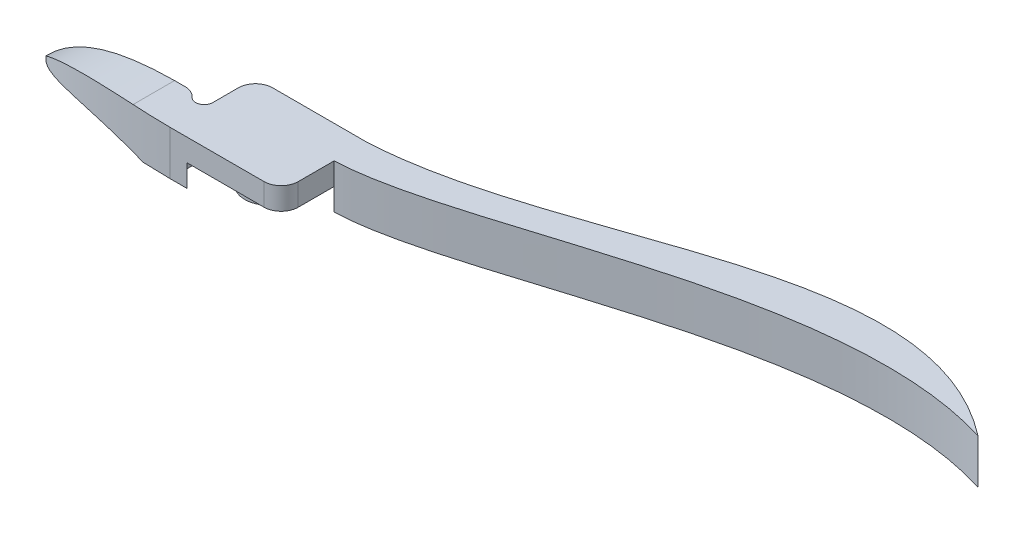
ISO-10303-21;
HEADER;
FILE_DESCRIPTION(('STEP AP214'),'2;1');
FILE_NAME('part.step','',(''),(''),'','','');
FILE_SCHEMA(('AUTOMOTIVE_DESIGN { 1 0 10303 214 1 1 1 1 }'));
ENDSEC;
DATA;
#1=APPLICATION_CONTEXT('core data for automotive mechanical design processes');
#2=APPLICATION_PROTOCOL_DEFINITION('international standard','automotive_design',2000,#1);
#3=PRODUCT_CONTEXT('',#1,'mechanical');
#4=PRODUCT('Part','Part','',(#3));
#5=PRODUCT_RELATED_PRODUCT_CATEGORY('part','',(#4));
#6=PRODUCT_DEFINITION_FORMATION('','',#4);
#7=PRODUCT_DEFINITION_CONTEXT('part definition',#1,'design');
#8=PRODUCT_DEFINITION('design','',#6,#7);
#9=PRODUCT_DEFINITION_SHAPE('','',#8);
#10=(LENGTH_UNIT() NAMED_UNIT(*) SI_UNIT(.MILLI.,.METRE.));
#11=(NAMED_UNIT(*) PLANE_ANGLE_UNIT() SI_UNIT($,.RADIAN.));
#12=(NAMED_UNIT(*) SI_UNIT($,.STERADIAN.) SOLID_ANGLE_UNIT());
#13=UNCERTAINTY_MEASURE_WITH_UNIT(LENGTH_MEASURE(1.E-05),#10,'distance_accuracy_value','');
#14=(GEOMETRIC_REPRESENTATION_CONTEXT(3) GLOBAL_UNCERTAINTY_ASSIGNED_CONTEXT((#13)) GLOBAL_UNIT_ASSIGNED_CONTEXT((#10,
#11,#12)) REPRESENTATION_CONTEXT('',''));
#15=CARTESIAN_POINT('',(0.,0.,0.));
#16=DIRECTION('',(0.,0.,1.));
#17=DIRECTION('',(1.,0.,0.));
#18=AXIS2_PLACEMENT_3D('',#15,#16,#17);
#19=CARTESIAN_POINT('',(-33.02,3.302,0.));
#20=CARTESIAN_POINT('',(-27.473096432597,3.302,6.22315986098551));
#21=CARTESIAN_POINT('',(-8.25499999999994,3.302,6.35));
#22=B_SPLINE_CURVE_WITH_KNOTS('',2,(#19,#20,#21),.UNSPECIFIED.,.F.,.F.,(3,3),(0.,1.),.UNSPECIFIED.);
#23=DIRECTION('',(0.,-1.,0.));
#24=VECTOR('',#23,1.);
#25=SURFACE_OF_LINEAR_EXTRUSION('',#22,#24);
#26=CARTESIAN_POINT('',(-33.02,-3.302,0.));
#27=CARTESIAN_POINT('',(-32.8493555262715,-3.23191102492854,0.191455572994813));
#28=CARTESIAN_POINT('',(-32.6712803221036,-3.16155099042531,0.376019685814025));
#29=CARTESIAN_POINT('',(-32.3025351047692,-3.02195048612788,0.731394631001662));
#30=CARTESIAN_POINT('',(-32.1119030977583,-2.95270736218043,0.90224378043286));
#31=CARTESIAN_POINT('',(-31.7194535669216,-2.81663188346119,1.23119449922115));
#32=CARTESIAN_POINT('',(-31.5176448250329,-2.74979770220064,1.38930584388313));
#33=CARTESIAN_POINT('',(-31.1068493182955,-2.62039434555366,1.69168586506872));
#34=CARTESIAN_POINT('',(-30.8979869134394,-2.55778164907948,1.8361053594339));
#35=CARTESIAN_POINT('',(-30.4718438568277,-2.43668640106267,2.11414393303659));
#36=CARTESIAN_POINT('',(-30.2545575546513,-2.37820669867898,2.247755570668));
#37=CARTESIAN_POINT('',(-29.8127787966357,-2.26602928752205,2.50482036263928));
#38=CARTESIAN_POINT('',(-29.5882838594076,-2.21233324993849,2.62826996570179));
#39=CARTESIAN_POINT('',(-29.0436517980687,-2.09013085422312,2.91235027700613));
#40=CARTESIAN_POINT('',(-28.7206197167618,-2.02410391595905,3.06851212350615));
#41=CARTESIAN_POINT('',(-28.0650059223243,-1.90314649690615,3.364153441573));
#42=CARTESIAN_POINT('',(-27.7324231650492,-1.84821723470581,3.50363108043291));
#43=CARTESIAN_POINT('',(-27.0596615216333,-1.74995444906151,3.76752460909254));
#44=CARTESIAN_POINT('',(-26.7194822372107,-1.70662153516172,3.89193970696487));
#45=CARTESIAN_POINT('',(-26.0307843289083,-1.63155871849199,4.12798692476388));
#46=CARTESIAN_POINT('',(-25.6822239339008,-1.59991238080401,4.23952320494405));
#47=CARTESIAN_POINT('',(-24.98053310519,-1.54876460290087,4.4501245389337));
#48=CARTESIAN_POINT('',(-24.6274031652878,-1.52926186141048,4.54919092807529));
#49=CARTESIAN_POINT('',(-23.9177111112223,-1.50240526794628,4.73606166228489));
#50=CARTESIAN_POINT('',(-23.5611487003343,-1.49505247595175,4.82386502413376));
#51=CARTESIAN_POINT('',(-22.6870108133602,-1.49188291053913,5.02593894914872));
#52=CARTESIAN_POINT('',(-22.1681212620189,-1.50262419495208,5.13469000922816));
#53=CARTESIAN_POINT('',(-21.1277968536637,-1.54914823001965,5.33374447517758));
#54=CARTESIAN_POINT('',(-20.6063611222535,-1.58494028706327,5.42404100905893));
#55=CARTESIAN_POINT('',(-19.5630919705991,-1.68143571779502,5.5885115446547));
#56=CARTESIAN_POINT('',(-19.0412584760049,-1.7421472613305,5.66268024665257));
#57=CARTESIAN_POINT('',(-18.0006763670951,-1.88827112310195,5.79667613792715));
#58=CARTESIAN_POINT('',(-17.4819232322313,-1.97361671213449,5.85654128271921));
#59=CARTESIAN_POINT('',(-16.4480455959767,-2.16921986273426,5.96387183841822));
#60=CARTESIAN_POINT('',(-15.9329198756559,-2.27946859934874,6.0113416290622));
#61=CARTESIAN_POINT('',(-14.9081383333329,-2.5252648857633,6.09536661321178));
#62=CARTESIAN_POINT('',(-14.3984793688402,-2.6607969752344,6.13192844142135));
#63=CARTESIAN_POINT('',(-13.6356505078139,-2.88471043582377,6.1798165038079));
#64=CARTESIAN_POINT('',(-13.3798295603584,-2.96342220284527,6.19470082326831));
#65=CARTESIAN_POINT('',(-12.8705555695267,-3.12759897118467,6.22214369241537));
#66=CARTESIAN_POINT('',(-12.6171001976962,-3.21305632055196,6.23470482485006));
#67=CARTESIAN_POINT('',(-12.3648063314247,-3.302,6.24619087496427));
#68=B_SPLINE_CURVE_WITH_KNOTS('',3,(#26,#27,#28,#29,#30,#31,#32,#33,#34,#35,#36,#37,#38,#39,#40,
#41,#42,#43,#44,#45,#46,#47,#48,#49,#50,#51,#52,#53,#54,#55,#56,#57,#58,#59,#60,#61,#62,#63,#64,
#65,#66,#67),.UNSPECIFIED.,.F.,.F.,(4,2,2,2,2,2,2,2,2,2,2,2,2,2,2,2,2,2,2,2,4),(0.,
0.797243659925846,1.5921762728664,2.38649290558763,3.17067983147115,3.9554021825044,
4.74039761265006,5.8340846084721,6.92789163220799,8.02175613893644,9.12329746767479,
10.2247207378736,11.3262400927683,12.9160146384745,14.5063801008409,16.0972673811179,
17.683885039876,19.2699413270169,20.8550309286911,21.6591486739592,22.4623670151177),.UNSPECIFIED.);
#69=CARTESIAN_POINT('',(-33.02,-3.302,0.));
#70=VERTEX_POINT('',#69);
#71=CARTESIAN_POINT('',(-12.3648063314247,-3.302,6.24619087474405));
#72=VERTEX_POINT('',#71);
#73=EDGE_CURVE('E361',#70,#72,#68,.T.);
#74=ORIENTED_EDGE('',*,*,#73,.T.);
#75=CARTESIAN_POINT('',(-33.02,-3.302,0.));
#76=CARTESIAN_POINT('',(-27.473096432597,-3.302,6.22315986098551));
#77=CARTESIAN_POINT('',(-8.25499999999994,-3.302,6.35));
#78=B_SPLINE_CURVE_WITH_KNOTS('',2,(#75,#76,#77),.UNSPECIFIED.,.F.,.F.,(3,3),(0.,1.),.UNSPECIFIED.);
#79=CARTESIAN_POINT('',(-8.255,-3.302,6.35));
#80=VERTEX_POINT('',#79);
#81=EDGE_CURVE('E224',#72,#80,#78,.T.);
#82=ORIENTED_EDGE('',*,*,#81,.T.);
#83=DIRECTION('',(0.,-1.,0.));
#84=VECTOR('',#83,1.);
#85=CARTESIAN_POINT('',(-8.255,3.302,6.35));
#86=LINE('',#85,#84);
#87=CARTESIAN_POINT('',(-8.255,3.302,6.35));
#88=VERTEX_POINT('',#87);
#89=EDGE_CURVE('E12',#88,#80,#86,.T.);
#90=ORIENTED_EDGE('',*,*,#89,.F.);
#91=CARTESIAN_POINT('',(-13.9218789110866,3.302,6.16184275451109));
#92=VERTEX_POINT('',#91);
#93=EDGE_CURVE('E119',#92,#88,#22,.T.);
#94=ORIENTED_EDGE('',*,*,#93,.F.);
#95=CARTESIAN_POINT('',(-13.9218789124482,3.30199999999994,6.16184275442513));
#96=CARTESIAN_POINT('',(-14.2757671587917,3.29807497459123,6.13949608522975));
#97=CARTESIAN_POINT('',(-14.6295015111341,3.29136135651999,6.11493106148992));
#98=CARTESIAN_POINT('',(-15.3366087323922,3.27172918300036,6.06100204686159));
#99=CARTESIAN_POINT('',(-15.6899813289981,3.25880749965579,6.03163564175186));
#100=CARTESIAN_POINT('',(-16.3959994084621,3.22613203775718,5.96775932544116));
#101=CARTESIAN_POINT('',(-16.7486447916846,3.20637737843231,5.93324875148313));
#102=CARTESIAN_POINT('',(-17.4580411622674,3.15900622958598,5.85814840924013));
#103=CARTESIAN_POINT('',(-17.8147761088024,3.13127821935011,5.81747658076509));
#104=CARTESIAN_POINT('',(-18.5267113011566,3.06732813468706,5.73000297352161));
#105=CARTESIAN_POINT('',(-18.8819116829497,3.03110682923011,5.6832017498687));
#106=CARTESIAN_POINT('',(-19.5903436081505,2.94936608040122,5.58298672496345));
#107=CARTESIAN_POINT('',(-19.9435748942931,2.90384545001304,5.52957207988138));
#108=CARTESIAN_POINT('',(-20.9588693978903,2.75792312557478,5.36521976693141));
#109=CARTESIAN_POINT('',(-21.6177092734333,2.64459484661716,5.24519587284131));
#110=CARTESIAN_POINT('',(-22.9212409606309,2.37628903121111,4.97615102574847));
#111=CARTESIAN_POINT('',(-23.5659305656395,2.22130504803414,4.82712558538847));
#112=CARTESIAN_POINT('',(-24.5148456016645,1.95450407200476,4.5794789719765));
#113=CARTESIAN_POINT('',(-24.827281708654,1.86016099940604,4.49318678844737));
#114=CARTESIAN_POINT('',(-25.4457787481901,1.65954853111274,4.31201146063032));
#115=CARTESIAN_POINT('',(-25.7518401045091,1.55327993120707,4.2171288896594));
#116=CARTESIAN_POINT('',(-26.3562691562426,1.3285915750584,4.01837020127277));
#117=CARTESIAN_POINT('',(-26.6546415329946,1.2101794419542,3.91449973235874));
#118=CARTESIAN_POINT('',(-27.2427587399877,0.96105209364033,3.69724172298386));
#119=CARTESIAN_POINT('',(-27.5325013541418,0.830333753500432,3.58385176602319));
#120=CARTESIAN_POINT('',(-28.218188902479,0.501000832942753,3.29886873251786));
#121=CARTESIAN_POINT('',(-28.6092813352912,0.296430002012325,3.12239130748748));
#122=CARTESIAN_POINT('',(-29.3683118481942,-0.135187222642011,2.74855160140704));
#123=CARTESIAN_POINT('',(-29.736257799875,-0.362225907233564,2.55119648228405));
#124=CARTESIAN_POINT('',(-30.209246604749,-0.677854162499141,2.27328886095922));
#125=CARTESIAN_POINT('',(-30.326002609069,-0.757819711930135,2.20259678842238));
#126=CARTESIAN_POINT('',(-30.5564976798568,-0.919752956621392,2.05868065779664));
#127=CARTESIAN_POINT('',(-30.6702372341323,-1.00172032398679,1.98545701356958));
#128=CARTESIAN_POINT('',(-31.0067870383155,-1.25039514132633,1.76188373463237));
#129=CARTESIAN_POINT('',(-31.2249605511133,-1.41989678983368,1.60761294884932));
#130=CARTESIAN_POINT('',(-31.6480344075935,-1.76467540864734,1.28806972880975));
#131=CARTESIAN_POINT('',(-31.8529425468534,-1.93994889398182,1.12280387390457));
#132=CARTESIAN_POINT('',(-32.1371239105262,-2.19432896995792,0.877014181604712));
#133=CARTESIAN_POINT('',(-32.2220217739333,-2.27186889567472,0.801317318518548));
#134=CARTESIAN_POINT('',(-32.3891206021983,-2.42748608680543,0.64758228583718));
#135=CARTESIAN_POINT('',(-32.4713221307051,-2.50556323573488,0.569544612185622));
#136=CARTESIAN_POINT('',(-32.7136458577688,-2.74013854204914,0.331907773391245));
#137=CARTESIAN_POINT('',(-32.86967332583,-2.89714783756021,0.168624454743414));
#138=CARTESIAN_POINT('',(-33.02,-3.05399492699543,0.));
#139=B_SPLINE_CURVE_WITH_KNOTS('',3,(#95,#96,#97,#98,#99,#100,#101,#102,#103,#104,#105,#106,
#107,#108,#109,#110,#111,#112,#113,#114,#115,#116,#117,#118,#119,#120,#121,#122,#123,#124,#125,
#126,#127,#128,#129,#130,#131,#132,#133,#134,#135,#136,#137,#138),.UNSPECIFIED.,.F.,.F.,(4,2,2,
2,2,2,2,2,2,2,2,2,2,2,2,2,2,2,2,2,2,4),(0.,1.06385184780087,2.12824027395346,3.19276595097234,
4.27297241019061,5.35308110686969,6.4333277607209,8.46918290407192,10.5053533024515,
11.5177893215878,12.5301578211261,13.5418946489719,14.5538890849416,15.9783987495692,
17.4024213224398,17.8769451441653,18.3513917540917,19.300156233718,20.2483580006092,
20.6612981518337,21.0741514236181,21.8989675965163),.UNSPECIFIED.);
#140=CARTESIAN_POINT('',(-33.02,-3.05399492699542,0.));
#141=VERTEX_POINT('',#140);
#142=EDGE_CURVE('E77',#92,#141,#139,.T.);
#143=ORIENTED_EDGE('',*,*,#142,.T.);
#144=DIRECTION('',(0.,-1.,0.));
#145=VECTOR('',#144,1.);
#146=CARTESIAN_POINT('',(-33.02,3.302,0.));
#147=LINE('',#146,#145);
#148=EDGE_CURVE('E180',#141,#70,#147,.T.);
#149=ORIENTED_EDGE('',*,*,#148,.T.);
#150=EDGE_LOOP('',(#74,#82,#90,#94,#143,#149));
#151=FACE_BOUND('',#150,.T.);
#152=ADVANCED_FACE('F60',(#151),#25,.F.);
#153=CARTESIAN_POINT('',(0.,3.302,0.));
#154=DIRECTION('',(0.,0.,1.));
#155=DIRECTION('',(1.,0.,0.));
#156=AXIS2_PLACEMENT_3D('',#153,#154,#155);
#157=PLANE('',#156);
#158=CARTESIAN_POINT('',(-12.3648063314247,-3.302,0.));
#159=CARTESIAN_POINT('',(-18.8048744708733,-1.03148335701843,0.));
#160=CARTESIAN_POINT('',(-26.8124714422319,-0.753963495491612,0.));
#161=CARTESIAN_POINT('',(-33.02,-3.30200000000001,0.));
#162=B_SPLINE_CURVE_WITH_KNOTS('',3,(#158,#159,#160,#161),.UNSPECIFIED.,.F.,.F.,(4,4),(0.,1.),.UNSPECIFIED.);
#163=CARTESIAN_POINT('',(-12.3648063314247,-3.302,0.));
#164=VERTEX_POINT('',#163);
#165=EDGE_CURVE('E372',#164,#70,#162,.T.);
#166=ORIENTED_EDGE('',*,*,#165,.T.);
#167=ORIENTED_EDGE('',*,*,#148,.F.);
#168=CARTESIAN_POINT('',(-33.02,-3.05399492699543,0.));
#169=CARTESIAN_POINT('',(-28.2378330119546,1.93464903660238,0.));
#170=CARTESIAN_POINT('',(-21.2907050841812,3.39591165007092,0.));
#171=CARTESIAN_POINT('',(-12.3648063314247,3.302,0.));
#172=B_SPLINE_CURVE_WITH_KNOTS('',3,(#168,#169,#170,#171),.UNSPECIFIED.,.F.,.F.,(4,4),(0.,1.),.UNSPECIFIED.);
#173=CARTESIAN_POINT('',(-13.9218789124441,3.302,0.));
#174=VERTEX_POINT('',#173);
#175=EDGE_CURVE('E203',#141,#174,#172,.T.);
#176=ORIENTED_EDGE('',*,*,#175,.T.);
#177=DIRECTION('',(-1.,0.,0.));
#178=VECTOR('',#177,1.);
#179=CARTESIAN_POINT('',(0.,3.302,0.));
#180=LINE('',#179,#178);
#181=CARTESIAN_POINT('',(-12.3648063314247,3.302,0.));
#182=VERTEX_POINT('',#181);
#183=EDGE_CURVE('E175',#182,#174,#180,.T.);
#184=ORIENTED_EDGE('',*,*,#183,.F.);
#185=DIRECTION('',(0.,-1.,0.));
#186=VECTOR('',#185,1.);
#187=CARTESIAN_POINT('',(-12.3648063314247,3.302,0.));
#188=LINE('',#187,#186);
#189=EDGE_CURVE('E86',#182,#164,#188,.T.);
#190=ORIENTED_EDGE('',*,*,#189,.T.);
#191=EDGE_LOOP('',(#166,#167,#176,#184,#190));
#192=FACE_BOUND('',#191,.T.);
#193=ADVANCED_FACE('F351',(#192),#157,.F.);
#194=CARTESIAN_POINT('',(0.,-3.302,0.));
#195=DIRECTION('',(0.,1.,0.));
#196=DIRECTION('',(0.,0.,1.));
#197=AXIS2_PLACEMENT_3D('',#194,#195,#196);
#198=PLANE('',#197);
#199=DIRECTION('',(0.,0.,-1.));
#200=VECTOR('',#199,1.);
#201=CARTESIAN_POINT('',(-12.3648063314247,-3.302,6.351));
#202=LINE('',#201,#200);
#203=EDGE_CURVE('E212',#72,#164,#202,.T.);
#204=ORIENTED_EDGE('',*,*,#203,.T.);
#205=CARTESIAN_POINT('',(-12.3648063314247,-3.302,2.54));
#206=DIRECTION('',(0.,1.,0.));
#207=DIRECTION('',(0.,0.,1.));
#208=AXIS2_PLACEMENT_3D('',#205,#206,#207);
#209=CIRCLE('',#208,2.54);
#210=CARTESIAN_POINT('',(-10.4716021104749,-3.302,0.846666666666668));
#211=VERTEX_POINT('',#210);
#212=EDGE_CURVE('E247',#164,#211,#209,.F.);
#213=ORIENTED_EDGE('',*,*,#212,.T.);
#214=CARTESIAN_POINT('',(-9.525,-3.302,0.));
#215=DIRECTION('',(0.,1.,0.));
#216=DIRECTION('',(0.,0.,1.));
#217=AXIS2_PLACEMENT_3D('',#214,#215,#216);
#218=CIRCLE('',#217,1.27);
#219=CARTESIAN_POINT('',(-8.255,-3.302,0.));
#220=VERTEX_POINT('',#219);
#221=EDGE_CURVE('E244',#211,#220,#218,.T.);
#222=ORIENTED_EDGE('',*,*,#221,.T.);
#223=DIRECTION('',(0.,0.,1.));
#224=VECTOR('',#223,1.);
#225=CARTESIAN_POINT('',(-8.255,-3.302,0.));
#226=LINE('',#225,#224);
#227=CARTESIAN_POINT('',(-8.255,-3.302,3.80999999999998));
#228=VERTEX_POINT('',#227);
#229=EDGE_CURVE('E241',#220,#228,#226,.T.);
#230=ORIENTED_EDGE('',*,*,#229,.T.);
#231=CARTESIAN_POINT('',(-5.715,-3.302,3.81));
#232=DIRECTION('',(0.,1.,0.));
#233=DIRECTION('',(0.,0.,1.));
#234=AXIS2_PLACEMENT_3D('',#231,#232,#233);
#235=CIRCLE('',#234,2.54);
#236=CARTESIAN_POINT('',(-5.71499999999998,-3.302,6.35));
#237=VERTEX_POINT('',#236);
#238=EDGE_CURVE('E238',#228,#237,#235,.T.);
#239=ORIENTED_EDGE('',*,*,#238,.T.);
#240=DIRECTION('',(-1.,0.,0.));
#241=VECTOR('',#240,1.);
#242=CARTESIAN_POINT('',(0.,-3.302,6.35));
#243=LINE('',#242,#241);
#244=EDGE_CURVE('E232',#237,#80,#243,.T.);
#245=ORIENTED_EDGE('',*,*,#244,.T.);
#246=ORIENTED_EDGE('',*,*,#81,.F.);
#247=EDGE_LOOP('',(#204,#213,#222,#230,#239,#245,#246));
#248=FACE_BOUND('',#247,.T.);
#249=ADVANCED_FACE('F356',(#248),#198,.F.);
#250=CARTESIAN_POINT('',(0.,3.302,0.));
#251=DIRECTION('',(0.,1.,0.));
#252=DIRECTION('',(0.,0.,1.));
#253=AXIS2_PLACEMENT_3D('',#250,#251,#252);
#254=PLANE('',#253);
#255=ORIENTED_EDGE('',*,*,#183,.T.);
#256=DIRECTION('',(0.,0.,-1.));
#257=VECTOR('',#256,1.);
#258=CARTESIAN_POINT('',(-13.9218789124441,3.302,6.351));
#259=LINE('',#258,#257);
#260=EDGE_CURVE('E201',#92,#174,#259,.T.);
#261=ORIENTED_EDGE('',*,*,#260,.F.);
#262=ORIENTED_EDGE('',*,*,#93,.T.);
#263=DIRECTION('',(1.,0.,0.));
#264=VECTOR('',#263,1.);
#265=CARTESIAN_POINT('',(0.,3.302,6.35));
#266=LINE('',#265,#264);
#267=CARTESIAN_POINT('',(5.71499999999998,3.302,6.35));
#268=VERTEX_POINT('',#267);
#269=EDGE_CURVE('E302',#88,#268,#266,.T.);
#270=ORIENTED_EDGE('',*,*,#269,.T.);
#271=CARTESIAN_POINT('',(5.715,3.302,3.81));
#272=DIRECTION('',(0.,1.,0.));
#273=DIRECTION('',(0.,0.,1.));
#274=AXIS2_PLACEMENT_3D('',#271,#272,#273);
#275=CIRCLE('',#274,2.54);
#276=CARTESIAN_POINT('',(8.255,3.302,3.80999999999998));
#277=VERTEX_POINT('',#276);
#278=EDGE_CURVE('E308',#268,#277,#275,.T.);
#279=ORIENTED_EDGE('',*,*,#278,.T.);
#280=DIRECTION('',(0.,0.,1.));
#281=VECTOR('',#280,1.);
#282=CARTESIAN_POINT('',(8.255,3.302,0.));
#283=LINE('',#282,#281);
#284=CARTESIAN_POINT('',(8.255,3.302,-1.524));
#285=VERTEX_POINT('',#284);
#286=EDGE_CURVE('E310',#285,#277,#283,.T.);
#287=ORIENTED_EDGE('',*,*,#286,.F.);
#288=CARTESIAN_POINT('',(8.255,3.302,-1.524));
#289=CARTESIAN_POINT('',(26.9221441817597,3.302,-2.15084961746132));
#290=CARTESIAN_POINT('',(62.6462462616133,3.302,-22.822886737911));
#291=CARTESIAN_POINT('',(91.4400000000001,3.302,-13.97));
#292=B_SPLINE_CURVE_WITH_KNOTS('',3,(#288,#289,#290,#291),.UNSPECIFIED.,.F.,.F.,(4,4),(0.,1.),.UNSPECIFIED.);
#293=CARTESIAN_POINT('',(91.4400000000001,3.302,-13.97));
#294=VERTEX_POINT('',#293);
#295=EDGE_CURVE('E313',#285,#294,#292,.T.);
#296=ORIENTED_EDGE('',*,*,#295,.T.);
#297=CARTESIAN_POINT('',(91.44,3.302,-13.97));
#298=CARTESIAN_POINT('',(66.350363847713,3.302,-33.3520512179018));
#299=CARTESIAN_POINT('',(36.8413371265353,3.302,-7.76465399928655));
#300=CARTESIAN_POINT('',(8.25499999999984,3.302,-6.35));
#301=B_SPLINE_CURVE_WITH_KNOTS('',3,(#297,#298,#299,#300),.UNSPECIFIED.,.F.,.F.,(4,4),(0.,1.),.UNSPECIFIED.);
#302=CARTESIAN_POINT('',(8.255,3.302,-6.35));
#303=VERTEX_POINT('',#302);
#304=EDGE_CURVE('E318',#294,#303,#301,.T.);
#305=ORIENTED_EDGE('',*,*,#304,.T.);
#306=DIRECTION('',(1.,0.,0.));
#307=VECTOR('',#306,1.);
#308=CARTESIAN_POINT('',(0.,3.302,-6.35));
#309=LINE('',#308,#307);
#310=CARTESIAN_POINT('',(-5.71499999999998,3.302,-6.35));
#311=VERTEX_POINT('',#310);
#312=EDGE_CURVE('E430',#311,#303,#309,.T.);
#313=ORIENTED_EDGE('',*,*,#312,.F.);
#314=CARTESIAN_POINT('',(-5.715,3.302,-3.81));
#315=DIRECTION('',(0.,1.,0.));
#316=DIRECTION('',(0.,0.,1.));
#317=AXIS2_PLACEMENT_3D('',#314,#315,#316);
#318=CIRCLE('',#317,2.54);
#319=CARTESIAN_POINT('',(-8.255,3.302,-3.80999999999998));
#320=VERTEX_POINT('',#319);
#321=EDGE_CURVE('E155',#311,#320,#318,.T.);
#322=ORIENTED_EDGE('',*,*,#321,.T.);
#323=DIRECTION('',(0.,0.,1.));
#324=VECTOR('',#323,1.);
#325=CARTESIAN_POINT('',(-8.255,3.302,0.));
#326=LINE('',#325,#324);
#327=CARTESIAN_POINT('',(-8.255,3.302,0.));
#328=VERTEX_POINT('',#327);
#329=EDGE_CURVE('E146',#320,#328,#326,.T.);
#330=ORIENTED_EDGE('',*,*,#329,.T.);
#331=CARTESIAN_POINT('',(-9.525,3.302,0.));
#332=DIRECTION('',(0.,1.,0.));
#333=DIRECTION('',(0.,0.,1.));
#334=AXIS2_PLACEMENT_3D('',#331,#332,#333);
#335=CIRCLE('',#334,1.27);
#336=CARTESIAN_POINT('',(-10.4716021104749,3.302,0.846666666666668));
#337=VERTEX_POINT('',#336);
#338=EDGE_CURVE('E152',#337,#328,#335,.T.);
#339=ORIENTED_EDGE('',*,*,#338,.F.);
#340=CARTESIAN_POINT('',(-12.3648063314247,3.302,2.54));
#341=DIRECTION('',(0.,1.,0.));
#342=DIRECTION('',(0.,0.,1.));
#343=AXIS2_PLACEMENT_3D('',#340,#341,#342);
#344=CIRCLE('',#343,2.54);
#345=EDGE_CURVE('E173',#182,#337,#344,.F.);
#346=ORIENTED_EDGE('',*,*,#345,.F.);
#347=EDGE_LOOP('',(#255,#261,#262,#270,#279,#287,#296,#305,#313,#322,#330,#339,#346));
#348=FACE_BOUND('',#347,.T.);
#349=ADVANCED_FACE('F149',(#348),#254,.T.);
#350=CARTESIAN_POINT('',(0.,0.,0.));
#351=DIRECTION('',(0.,1.,0.));
#352=DIRECTION('',(0.,0.,1.));
#353=AXIS2_PLACEMENT_3D('',#350,#351,#352);
#354=PLANE('',#353);
#355=CARTESIAN_POINT('',(0.,0.,0.));
#356=DIRECTION('',(0.,1.,0.));
#357=DIRECTION('',(0.,0.,1.));
#358=AXIS2_PLACEMENT_3D('',#355,#356,#357);
#359=CIRCLE('',#358,3.4925);
#360=CARTESIAN_POINT('',(0.,0.,3.4925));
#361=VERTEX_POINT('',#360);
#362=EDGE_CURVE('E373',#361,#361,#359,.T.);
#363=ORIENTED_EDGE('',*,*,#362,.T.);
#364=EDGE_LOOP('',(#363));
#365=FACE_BOUND('',#364,.T.);
#366=DIRECTION('',(0.,0.,1.));
#367=VECTOR('',#366,1.);
#368=CARTESIAN_POINT('',(-8.255,0.,0.));
#369=LINE('',#368,#367);
#370=CARTESIAN_POINT('',(-8.255,0.,0.));
#371=VERTEX_POINT('',#370);
#372=CARTESIAN_POINT('',(-8.255,0.,3.80999999999998));
#373=VERTEX_POINT('',#372);
#374=EDGE_CURVE('E207',#371,#373,#369,.T.);
#375=ORIENTED_EDGE('',*,*,#374,.F.);
#376=DIRECTION('',(0.,0.,1.));
#377=VECTOR('',#376,1.);
#378=CARTESIAN_POINT('',(-8.255,0.,0.));
#379=LINE('',#378,#377);
#380=CARTESIAN_POINT('',(-8.255,0.,-3.80999999999998));
#381=VERTEX_POINT('',#380);
#382=EDGE_CURVE('E164',#381,#371,#379,.T.);
#383=ORIENTED_EDGE('',*,*,#382,.F.);
#384=CARTESIAN_POINT('',(-5.715,0.,-3.81));
#385=DIRECTION('',(0.,1.,0.));
#386=DIRECTION('',(0.,0.,1.));
#387=AXIS2_PLACEMENT_3D('',#384,#385,#386);
#388=CIRCLE('',#387,2.54);
#389=CARTESIAN_POINT('',(-5.71499999999998,0.,-6.35));
#390=VERTEX_POINT('',#389);
#391=EDGE_CURVE('E111',#390,#381,#388,.T.);
#392=ORIENTED_EDGE('',*,*,#391,.F.);
#393=DIRECTION('',(1.,0.,0.));
#394=VECTOR('',#393,1.);
#395=CARTESIAN_POINT('',(0.,0.,-6.35));
#396=LINE('',#395,#394);
#397=CARTESIAN_POINT('',(5.71499999999998,0.,-6.35));
#398=VERTEX_POINT('',#397);
#399=EDGE_CURVE('E190',#390,#398,#396,.T.);
#400=ORIENTED_EDGE('',*,*,#399,.T.);
#401=CARTESIAN_POINT('',(5.715,0.,-3.81));
#402=DIRECTION('',(0.,1.,0.));
#403=DIRECTION('',(0.,0.,1.));
#404=AXIS2_PLACEMENT_3D('',#401,#402,#403);
#405=CIRCLE('',#404,2.54);
#406=CARTESIAN_POINT('',(8.255,0.,-3.80999999999998));
#407=VERTEX_POINT('',#406);
#408=EDGE_CURVE('E256',#398,#407,#405,.F.);
#409=ORIENTED_EDGE('',*,*,#408,.T.);
#410=DIRECTION('',(0.,0.,1.));
#411=VECTOR('',#410,1.);
#412=CARTESIAN_POINT('',(8.255,0.,0.));
#413=LINE('',#412,#411);
#414=CARTESIAN_POINT('',(8.255,0.,-1.524));
#415=VERTEX_POINT('',#414);
#416=EDGE_CURVE('E268',#407,#415,#413,.T.);
#417=ORIENTED_EDGE('',*,*,#416,.T.);
#418=DIRECTION('',(0.,0.,1.));
#419=VECTOR('',#418,1.);
#420=CARTESIAN_POINT('',(8.255,0.,0.));
#421=LINE('',#420,#419);
#422=CARTESIAN_POINT('',(8.255,0.,3.80999999999998));
#423=VERTEX_POINT('',#422);
#424=EDGE_CURVE('E187',#415,#423,#421,.T.);
#425=ORIENTED_EDGE('',*,*,#424,.T.);
#426=CARTESIAN_POINT('',(5.715,0.,3.81));
#427=DIRECTION('',(0.,1.,0.));
#428=DIRECTION('',(0.,0.,1.));
#429=AXIS2_PLACEMENT_3D('',#426,#427,#428);
#430=CIRCLE('',#429,2.54);
#431=CARTESIAN_POINT('',(5.71499999999998,0.,6.35));
#432=VERTEX_POINT('',#431);
#433=EDGE_CURVE('E183',#432,#423,#430,.T.);
#434=ORIENTED_EDGE('',*,*,#433,.F.);
#435=DIRECTION('',(1.,0.,0.));
#436=VECTOR('',#435,1.);
#437=CARTESIAN_POINT('',(0.,0.,6.35));
#438=LINE('',#437,#436);
#439=CARTESIAN_POINT('',(-5.71499999999998,0.,6.35));
#440=VERTEX_POINT('',#439);
#441=EDGE_CURVE('E181',#440,#432,#438,.T.);
#442=ORIENTED_EDGE('',*,*,#441,.F.);
#443=CARTESIAN_POINT('',(-5.715,0.,3.81));
#444=DIRECTION('',(0.,1.,0.));
#445=DIRECTION('',(0.,0.,1.));
#446=AXIS2_PLACEMENT_3D('',#443,#444,#445);
#447=CIRCLE('',#446,2.54);
#448=EDGE_CURVE('E202',#373,#440,#447,.T.);
#449=ORIENTED_EDGE('',*,*,#448,.F.);
#450=EDGE_LOOP('',(#375,#383,#392,#400,#409,#417,#425,#434,#442,#449));
#451=FACE_BOUND('',#450,.T.);
#452=ADVANCED_FACE('F343',(#365,#451),#354,.F.);
#453=CARTESIAN_POINT('',(0.,3.302,6.35));
#454=DIRECTION('',(0.,0.,-1.));
#455=DIRECTION('',(-1.,0.,0.));
#456=AXIS2_PLACEMENT_3D('',#453,#454,#455);
#457=PLANE('',#456);
#458=ORIENTED_EDGE('',*,*,#89,.T.);
#459=ORIENTED_EDGE('',*,*,#244,.F.);
#460=DIRECTION('',(0.,1.,0.));
#461=VECTOR('',#460,1.);
#462=CARTESIAN_POINT('',(-5.71499999999998,-3.302,6.35));
#463=LINE('',#462,#461);
#464=EDGE_CURVE('E249',#237,#440,#463,.T.);
#465=ORIENTED_EDGE('',*,*,#464,.T.);
#466=ORIENTED_EDGE('',*,*,#441,.T.);
#467=DIRECTION('',(0.,-1.,0.));
#468=VECTOR('',#467,1.);
#469=CARTESIAN_POINT('',(5.71499999999998,3.302,6.35));
#470=LINE('',#469,#468);
#471=EDGE_CURVE('E69',#268,#432,#470,.T.);
#472=ORIENTED_EDGE('',*,*,#471,.F.);
#473=ORIENTED_EDGE('',*,*,#269,.F.);
#474=EDGE_LOOP('',(#458,#459,#465,#466,#472,#473));
#475=FACE_BOUND('',#474,.T.);
#476=ADVANCED_FACE('F340',(#475),#457,.F.);
#477=CARTESIAN_POINT('',(5.715,3.302,3.81));
#478=DIRECTION('',(0.,-1.,0.));
#479=DIRECTION('',(0.,0.,-1.));
#480=AXIS2_PLACEMENT_3D('',#477,#478,#479);
#481=CYLINDRICAL_SURFACE('',#480,2.54);
#482=ORIENTED_EDGE('',*,*,#433,.T.);
#483=DIRECTION('',(0.,-1.,0.));
#484=VECTOR('',#483,1.);
#485=CARTESIAN_POINT('',(8.255,3.302,3.80999999999998));
#486=LINE('',#485,#484);
#487=EDGE_CURVE('E448',#277,#423,#486,.T.);
#488=ORIENTED_EDGE('',*,*,#487,.F.);
#489=ORIENTED_EDGE('',*,*,#278,.F.);
#490=ORIENTED_EDGE('',*,*,#471,.T.);
#491=EDGE_LOOP('',(#482,#488,#489,#490));
#492=FACE_BOUND('',#491,.T.);
#493=ADVANCED_FACE('F337',(#492),#481,.T.);
#494=CARTESIAN_POINT('',(8.255,3.302,0.));
#495=DIRECTION('',(1.,0.,0.));
#496=DIRECTION('',(0.,0.,-1.));
#497=AXIS2_PLACEMENT_3D('',#494,#495,#496);
#498=PLANE('',#497);
#499=ORIENTED_EDGE('',*,*,#424,.F.);
#500=DIRECTION('',(0.,-1.,0.));
#501=VECTOR('',#500,1.);
#502=CARTESIAN_POINT('',(8.255,3.302,-1.524));
#503=LINE('',#502,#501);
#504=EDGE_CURVE('E443',#285,#415,#503,.T.);
#505=ORIENTED_EDGE('',*,*,#504,.F.);
#506=ORIENTED_EDGE('',*,*,#286,.T.);
#507=ORIENTED_EDGE('',*,*,#487,.T.);
#508=EDGE_LOOP('',(#499,#505,#506,#507));
#509=FACE_BOUND('',#508,.T.);
#510=ADVANCED_FACE('F332',(#509),#498,.T.);
#511=DIRECTION('',(0.,-1.,0.));
#512=VECTOR('',#511,1.);
#513=SURFACE_OF_LINEAR_EXTRUSION('',#292,#512);
#514=ORIENTED_EDGE('',*,*,#504,.T.);
#515=DIRECTION('',(0.,1.,0.));
#516=VECTOR('',#515,1.);
#517=CARTESIAN_POINT('',(8.255,-3.302,-1.524));
#518=LINE('',#517,#516);
#519=CARTESIAN_POINT('',(8.255,-3.302,-1.524));
#520=VERTEX_POINT('',#519);
#521=EDGE_CURVE('E184',#520,#415,#518,.T.);
#522=ORIENTED_EDGE('',*,*,#521,.F.);
#523=CARTESIAN_POINT('',(8.255,-3.302,-1.524));
#524=CARTESIAN_POINT('',(26.9221441817597,-3.302,-2.15084961746132));
#525=CARTESIAN_POINT('',(62.6462462616133,-3.302,-22.822886737911));
#526=CARTESIAN_POINT('',(91.4400000000001,-3.302,-13.97));
#527=B_SPLINE_CURVE_WITH_KNOTS('',3,(#523,#524,#525,#526),.UNSPECIFIED.,.F.,.F.,(4,4),(0.,1.),.UNSPECIFIED.);
#528=CARTESIAN_POINT('',(91.4400000000001,-3.302,-13.97));
#529=VERTEX_POINT('',#528);
#530=EDGE_CURVE('E262',#520,#529,#527,.T.);
#531=ORIENTED_EDGE('',*,*,#530,.T.);
#532=DIRECTION('',(0.,-1.,0.));
#533=VECTOR('',#532,1.);
#534=CARTESIAN_POINT('',(91.4400000000001,3.302,-13.97));
#535=LINE('',#534,#533);
#536=EDGE_CURVE('E441',#294,#529,#535,.T.);
#537=ORIENTED_EDGE('',*,*,#536,.F.);
#538=ORIENTED_EDGE('',*,*,#295,.F.);
#539=EDGE_LOOP('',(#514,#522,#531,#537,#538));
#540=FACE_BOUND('',#539,.T.);
#541=ADVANCED_FACE('F327',(#540),#513,.F.);
#542=DIRECTION('',(0.,-1.,0.));
#543=VECTOR('',#542,1.);
#544=SURFACE_OF_LINEAR_EXTRUSION('',#301,#543);
#545=ORIENTED_EDGE('',*,*,#536,.T.);
#546=CARTESIAN_POINT('',(91.44,-3.302,-13.97));
#547=CARTESIAN_POINT('',(66.350363847713,-3.302,-33.3520512179018));
#548=CARTESIAN_POINT('',(36.8413371265353,-3.302,-7.76465399928655));
#549=CARTESIAN_POINT('',(8.25499999999984,-3.302,-6.35));
#550=B_SPLINE_CURVE_WITH_KNOTS('',3,(#546,#547,#548,#549),.UNSPECIFIED.,.F.,.F.,(4,4),(0.,1.),.UNSPECIFIED.);
#551=CARTESIAN_POINT('',(8.255,-3.302,-6.35));
#552=VERTEX_POINT('',#551);
#553=EDGE_CURVE('E267',#529,#552,#550,.T.);
#554=ORIENTED_EDGE('',*,*,#553,.T.);
#555=DIRECTION('',(0.,-1.,0.));
#556=VECTOR('',#555,1.);
#557=CARTESIAN_POINT('',(8.255,3.302,-6.35));
#558=LINE('',#557,#556);
#559=EDGE_CURVE('E431',#303,#552,#558,.T.);
#560=ORIENTED_EDGE('',*,*,#559,.F.);
#561=ORIENTED_EDGE('',*,*,#304,.F.);
#562=EDGE_LOOP('',(#545,#554,#560,#561));
#563=FACE_BOUND('',#562,.T.);
#564=ADVANCED_FACE('F331',(#563),#544,.F.);
#565=CARTESIAN_POINT('',(0.,3.302,-6.35));
#566=DIRECTION('',(0.,0.,-1.));
#567=DIRECTION('',(-1.,0.,0.));
#568=AXIS2_PLACEMENT_3D('',#565,#566,#567);
#569=PLANE('',#568);
#570=ORIENTED_EDGE('',*,*,#399,.F.);
#571=DIRECTION('',(0.,-1.,0.));
#572=VECTOR('',#571,1.);
#573=CARTESIAN_POINT('',(-5.71499999999998,3.302,-6.35));
#574=LINE('',#573,#572);
#575=EDGE_CURVE('E429',#311,#390,#574,.T.);
#576=ORIENTED_EDGE('',*,*,#575,.F.);
#577=ORIENTED_EDGE('',*,*,#312,.T.);
#578=ORIENTED_EDGE('',*,*,#559,.T.);
#579=DIRECTION('',(1.,0.,0.));
#580=VECTOR('',#579,1.);
#581=CARTESIAN_POINT('',(0.,-3.302,-6.35));
#582=LINE('',#581,#580);
#583=CARTESIAN_POINT('',(5.71499999999998,-3.302,-6.35));
#584=VERTEX_POINT('',#583);
#585=EDGE_CURVE('E276',#584,#552,#582,.T.);
#586=ORIENTED_EDGE('',*,*,#585,.F.);
#587=DIRECTION('',(0.,1.,0.));
#588=VECTOR('',#587,1.);
#589=CARTESIAN_POINT('',(5.71499999999998,-3.302,-6.35));
#590=LINE('',#589,#588);
#591=EDGE_CURVE('E288',#584,#398,#590,.T.);
#592=ORIENTED_EDGE('',*,*,#591,.T.);
#593=EDGE_LOOP('',(#570,#576,#577,#578,#586,#592));
#594=FACE_BOUND('',#593,.T.);
#595=ADVANCED_FACE('F427',(#594),#569,.T.);
#596=CARTESIAN_POINT('',(-5.715,3.302,-3.81));
#597=DIRECTION('',(0.,-1.,0.));
#598=DIRECTION('',(0.,0.,-1.));
#599=AXIS2_PLACEMENT_3D('',#596,#597,#598);
#600=CYLINDRICAL_SURFACE('',#599,2.54);
#601=ORIENTED_EDGE('',*,*,#391,.T.);
#602=DIRECTION('',(0.,-1.,0.));
#603=VECTOR('',#602,1.);
#604=CARTESIAN_POINT('',(-8.255,3.302,-3.80999999999998));
#605=LINE('',#604,#603);
#606=EDGE_CURVE('E167',#320,#381,#605,.T.);
#607=ORIENTED_EDGE('',*,*,#606,.F.);
#608=ORIENTED_EDGE('',*,*,#321,.F.);
#609=ORIENTED_EDGE('',*,*,#575,.T.);
#610=EDGE_LOOP('',(#601,#607,#608,#609));
#611=FACE_BOUND('',#610,.T.);
#612=ADVANCED_FACE('F433',(#611),#600,.T.);
#613=CARTESIAN_POINT('',(-8.255,3.302,0.));
#614=DIRECTION('',(1.,0.,0.));
#615=DIRECTION('',(0.,0.,-1.));
#616=AXIS2_PLACEMENT_3D('',#613,#614,#615);
#617=PLANE('',#616);
#618=ORIENTED_EDGE('',*,*,#382,.T.);
#619=DIRECTION('',(0.,-1.,0.));
#620=VECTOR('',#619,1.);
#621=CARTESIAN_POINT('',(-8.255,3.302,0.));
#622=LINE('',#621,#620);
#623=EDGE_CURVE('E160',#328,#371,#622,.T.);
#624=ORIENTED_EDGE('',*,*,#623,.F.);
#625=ORIENTED_EDGE('',*,*,#329,.F.);
#626=ORIENTED_EDGE('',*,*,#606,.T.);
#627=EDGE_LOOP('',(#618,#624,#625,#626));
#628=FACE_BOUND('',#627,.T.);
#629=ADVANCED_FACE('F161',(#628),#617,.F.);
#630=CARTESIAN_POINT('',(-9.525,3.302,0.));
#631=DIRECTION('',(0.,-1.,0.));
#632=DIRECTION('',(0.,0.,-1.));
#633=AXIS2_PLACEMENT_3D('',#630,#631,#632);
#634=CYLINDRICAL_SURFACE('',#633,1.27);
#635=ORIENTED_EDGE('',*,*,#623,.T.);
#636=DIRECTION('',(0.,1.,0.));
#637=VECTOR('',#636,1.);
#638=CARTESIAN_POINT('',(-8.255,-3.302,0.));
#639=LINE('',#638,#637);
#640=EDGE_CURVE('E253',#220,#371,#639,.T.);
#641=ORIENTED_EDGE('',*,*,#640,.F.);
#642=ORIENTED_EDGE('',*,*,#221,.F.);
#643=DIRECTION('',(0.,-1.,0.));
#644=VECTOR('',#643,1.);
#645=CARTESIAN_POINT('',(-10.4716021104749,3.302,0.846666666666668));
#646=LINE('',#645,#644);
#647=EDGE_CURVE('E168',#337,#211,#646,.T.);
#648=ORIENTED_EDGE('',*,*,#647,.F.);
#649=ORIENTED_EDGE('',*,*,#338,.T.);
#650=EDGE_LOOP('',(#635,#641,#642,#648,#649));
#651=FACE_BOUND('',#650,.T.);
#652=ADVANCED_FACE('F170',(#651),#634,.F.);
#653=CARTESIAN_POINT('',(-12.3648063314247,3.302,2.54));
#654=DIRECTION('',(0.,-1.,0.));
#655=DIRECTION('',(0.,0.,-1.));
#656=AXIS2_PLACEMENT_3D('',#653,#654,#655);
#657=CYLINDRICAL_SURFACE('',#656,2.54);
#658=ORIENTED_EDGE('',*,*,#647,.T.);
#659=ORIENTED_EDGE('',*,*,#212,.F.);
#660=ORIENTED_EDGE('',*,*,#189,.F.);
#661=ORIENTED_EDGE('',*,*,#345,.T.);
#662=EDGE_LOOP('',(#658,#659,#660,#661));
#663=FACE_BOUND('',#662,.T.);
#664=ADVANCED_FACE('F508',(#663),#657,.T.);
#665=CARTESIAN_POINT('',(8.255,-3.302,0.));
#666=DIRECTION('',(-1.,0.,0.));
#667=DIRECTION('',(0.,0.,1.));
#668=AXIS2_PLACEMENT_3D('',#665,#666,#667);
#669=PLANE('',#668);
#670=ORIENTED_EDGE('',*,*,#416,.F.);
#671=DIRECTION('',(0.,1.,0.));
#672=VECTOR('',#671,1.);
#673=CARTESIAN_POINT('',(8.255,-3.302,-3.80999999999998));
#674=LINE('',#673,#672);
#675=CARTESIAN_POINT('',(8.255,-3.302,-3.80999999999998));
#676=VERTEX_POINT('',#675);
#677=EDGE_CURVE('E294',#676,#407,#674,.T.);
#678=ORIENTED_EDGE('',*,*,#677,.F.);
#679=DIRECTION('',(0.,0.,1.));
#680=VECTOR('',#679,1.);
#681=CARTESIAN_POINT('',(8.255,-3.302,0.));
#682=LINE('',#681,#680);
#683=EDGE_CURVE('E285',#676,#520,#682,.T.);
#684=ORIENTED_EDGE('',*,*,#683,.T.);
#685=ORIENTED_EDGE('',*,*,#521,.T.);
#686=EDGE_LOOP('',(#670,#678,#684,#685));
#687=FACE_BOUND('',#686,.T.);
#688=ADVANCED_FACE('F423',(#687),#669,.T.);
#689=CARTESIAN_POINT('',(5.715,-3.302,-3.81));
#690=DIRECTION('',(0.,1.,0.));
#691=DIRECTION('',(0.,0.,1.));
#692=AXIS2_PLACEMENT_3D('',#689,#690,#691);
#693=CYLINDRICAL_SURFACE('',#692,2.54);
#694=ORIENTED_EDGE('',*,*,#408,.F.);
#695=ORIENTED_EDGE('',*,*,#591,.F.);
#696=CARTESIAN_POINT('',(5.715,-3.302,-3.81));
#697=DIRECTION('',(0.,1.,0.));
#698=DIRECTION('',(0.,0.,1.));
#699=AXIS2_PLACEMENT_3D('',#696,#697,#698);
#700=CIRCLE('',#699,2.54);
#701=EDGE_CURVE('E282',#584,#676,#700,.F.);
#702=ORIENTED_EDGE('',*,*,#701,.T.);
#703=ORIENTED_EDGE('',*,*,#677,.T.);
#704=EDGE_LOOP('',(#694,#695,#702,#703));
#705=FACE_BOUND('',#704,.T.);
#706=ADVANCED_FACE('F419',(#705),#693,.F.);
#707=CARTESIAN_POINT('',(0.,-3.302,0.));
#708=DIRECTION('',(0.,1.,0.));
#709=DIRECTION('',(0.,0.,1.));
#710=AXIS2_PLACEMENT_3D('',#707,#708,#709);
#711=PLANE('',#710);
#712=ORIENTED_EDGE('',*,*,#530,.F.);
#713=ORIENTED_EDGE('',*,*,#683,.F.);
#714=ORIENTED_EDGE('',*,*,#701,.F.);
#715=ORIENTED_EDGE('',*,*,#585,.T.);
#716=ORIENTED_EDGE('',*,*,#553,.F.);
#717=EDGE_LOOP('',(#712,#713,#714,#715,#716));
#718=FACE_BOUND('',#717,.T.);
#719=ADVANCED_FACE('F498',(#718),#711,.F.);
#720=CARTESIAN_POINT('',(-8.255,-3.302,0.));
#721=DIRECTION('',(-1.,0.,0.));
#722=DIRECTION('',(0.,0.,1.));
#723=AXIS2_PLACEMENT_3D('',#720,#721,#722);
#724=PLANE('',#723);
#725=ORIENTED_EDGE('',*,*,#374,.T.);
#726=DIRECTION('',(0.,1.,0.));
#727=VECTOR('',#726,1.);
#728=CARTESIAN_POINT('',(-8.255,-3.302,3.80999999999998));
#729=LINE('',#728,#727);
#730=EDGE_CURVE('E257',#228,#373,#729,.T.);
#731=ORIENTED_EDGE('',*,*,#730,.F.);
#732=ORIENTED_EDGE('',*,*,#229,.F.);
#733=ORIENTED_EDGE('',*,*,#640,.T.);
#734=EDGE_LOOP('',(#725,#731,#732,#733));
#735=FACE_BOUND('',#734,.T.);
#736=ADVANCED_FACE('F495',(#735),#724,.F.);
#737=CARTESIAN_POINT('',(-5.715,-3.302,3.81));
#738=DIRECTION('',(0.,1.,0.));
#739=DIRECTION('',(0.,0.,1.));
#740=AXIS2_PLACEMENT_3D('',#737,#738,#739);
#741=CYLINDRICAL_SURFACE('',#740,2.54);
#742=ORIENTED_EDGE('',*,*,#448,.T.);
#743=ORIENTED_EDGE('',*,*,#464,.F.);
#744=ORIENTED_EDGE('',*,*,#238,.F.);
#745=ORIENTED_EDGE('',*,*,#730,.T.);
#746=EDGE_LOOP('',(#742,#743,#744,#745));
#747=FACE_BOUND('',#746,.T.);
#748=ADVANCED_FACE('F492',(#747),#741,.F.);
#749=CARTESIAN_POINT('',(-33.02,-3.05399492699543,6.351));
#750=CARTESIAN_POINT('',(-28.2378330119546,1.93464903660238,6.351));
#751=CARTESIAN_POINT('',(-21.2907050841812,3.39591165007092,6.351));
#752=CARTESIAN_POINT('',(-12.3648063314247,3.302,6.351));
#753=B_SPLINE_CURVE_WITH_KNOTS('',3,(#749,#750,#751,#752),.UNSPECIFIED.,.F.,.F.,(4,4),(0.,1.),.UNSPECIFIED.);
#754=DIRECTION('',(0.,0.,-1.));
#755=VECTOR('',#754,1.);
#756=SURFACE_OF_LINEAR_EXTRUSION('',#753,#755);
#757=ORIENTED_EDGE('',*,*,#260,.T.);
#758=ORIENTED_EDGE('',*,*,#175,.F.);
#759=ORIENTED_EDGE('',*,*,#142,.F.);
#760=EDGE_LOOP('',(#757,#758,#759));
#761=FACE_BOUND('',#760,.T.);
#762=ADVANCED_FACE('F484',(#761),#756,.T.);
#763=CARTESIAN_POINT('',(-12.3648063314247,-3.302,6.351));
#764=CARTESIAN_POINT('',(-18.8048744708733,-1.03148335701843,6.351));
#765=CARTESIAN_POINT('',(-26.8124714422319,-0.753963495491612,6.351));
#766=CARTESIAN_POINT('',(-33.02,-3.30200000000001,6.351));
#767=B_SPLINE_CURVE_WITH_KNOTS('',3,(#763,#764,#765,#766),.UNSPECIFIED.,.F.,.F.,(4,4),(0.,1.),.UNSPECIFIED.);
#768=DIRECTION('',(0.,0.,-1.));
#769=VECTOR('',#768,1.);
#770=SURFACE_OF_LINEAR_EXTRUSION('',#767,#769);
#771=ORIENTED_EDGE('',*,*,#165,.F.);
#772=ORIENTED_EDGE('',*,*,#203,.F.);
#773=ORIENTED_EDGE('',*,*,#73,.F.);
#774=EDGE_LOOP('',(#771,#772,#773));
#775=FACE_BOUND('',#774,.T.);
#776=ADVANCED_FACE('F481',(#775),#770,.T.);
#777=CARTESIAN_POINT('',(0.,-3.302,0.));
#778=DIRECTION('',(0.,1.,0.));
#779=DIRECTION('',(0.,0.,1.));
#780=AXIS2_PLACEMENT_3D('',#777,#778,#779);
#781=CYLINDRICAL_SURFACE('',#780,3.4925);
#782=CARTESIAN_POINT('',(0.,-3.302,0.));
#783=DIRECTION('',(0.,1.,0.));
#784=DIRECTION('',(0.,0.,1.));
#785=AXIS2_PLACEMENT_3D('',#782,#783,#784);
#786=CIRCLE('',#785,3.4925);
#787=CARTESIAN_POINT('',(0.,-3.302,3.4925));
#788=VERTEX_POINT('',#787);
#789=EDGE_CURVE('E758',#788,#788,#786,.T.);
#790=ORIENTED_EDGE('',*,*,#789,.T.);
#791=EDGE_LOOP('',(#790));
#792=FACE_BOUND('',#791,.T.);
#793=ORIENTED_EDGE('',*,*,#362,.F.);
#794=EDGE_LOOP('',(#793));
#795=FACE_BOUND('',#794,.T.);
#796=ADVANCED_FACE('F593',(#792,#795),#781,.T.);
#797=CARTESIAN_POINT('',(0.,-3.302,0.));
#798=DIRECTION('',(0.,1.,0.));
#799=DIRECTION('',(0.,0.,1.));
#800=AXIS2_PLACEMENT_3D('',#797,#798,#799);
#801=PLANE('',#800);
#802=ORIENTED_EDGE('',*,*,#789,.F.);
#803=EDGE_LOOP('',(#802));
#804=FACE_BOUND('',#803,.T.);
#805=ADVANCED_FACE('F600',(#804),#801,.F.);
#806=CLOSED_SHELL('',(#152,#193,#249,#349,#452,#476,#493,#510,#541,#564,#595,#612,#629,#652,
#664,#688,#706,#719,#736,#748,#762,#776,#796,#805));
#807=MANIFOLD_SOLID_BREP('B2',#806);
#808=ADVANCED_BREP_SHAPE_REPRESENTATION('',(#18,#807),#14);
#809=SHAPE_DEFINITION_REPRESENTATION(#9,#808);
ENDSEC;
END-ISO-10303-21;
